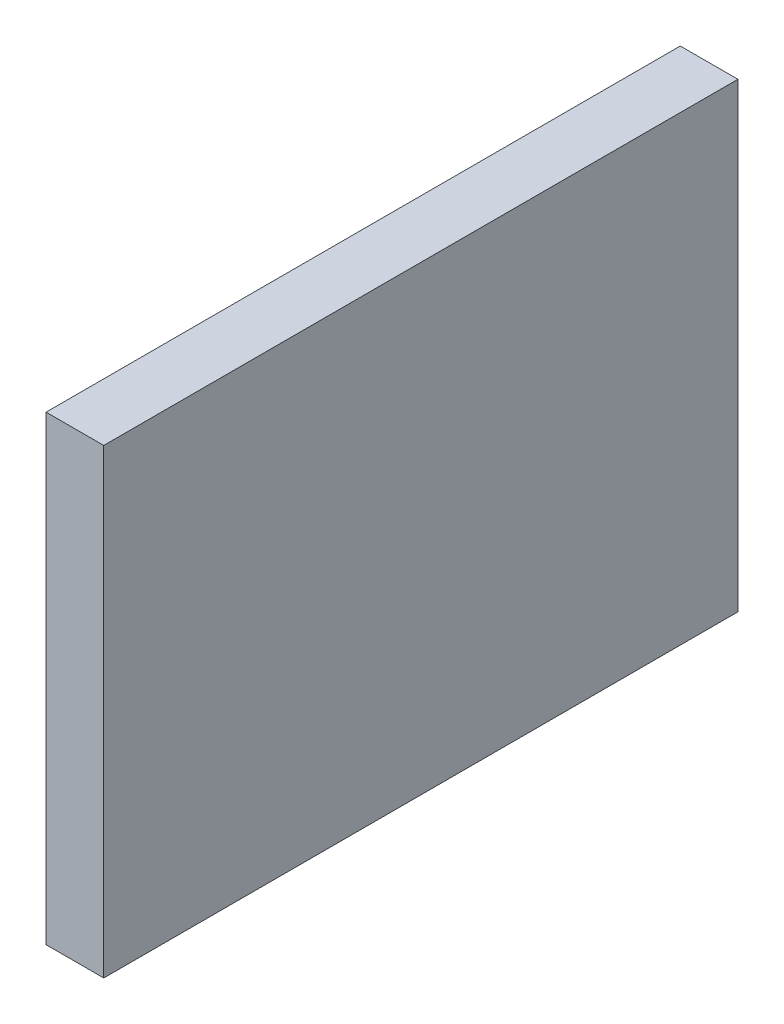
ISO-10303-21;
HEADER;
FILE_DESCRIPTION(('STEP AP214'),'2;1');
FILE_NAME('part.step','',(''),(''),'','','');
FILE_SCHEMA(('AUTOMOTIVE_DESIGN { 1 0 10303 214 1 1 1 1 }'));
ENDSEC;
DATA;
#1=APPLICATION_CONTEXT('core data for automotive mechanical design processes');
#2=APPLICATION_PROTOCOL_DEFINITION('international standard','automotive_design',2000,#1);
#3=PRODUCT_CONTEXT('',#1,'mechanical');
#4=PRODUCT('Part','Part','',(#3));
#5=PRODUCT_RELATED_PRODUCT_CATEGORY('part','',(#4));
#6=PRODUCT_DEFINITION_FORMATION('','',#4);
#7=PRODUCT_DEFINITION_CONTEXT('part definition',#1,'design');
#8=PRODUCT_DEFINITION('design','',#6,#7);
#9=PRODUCT_DEFINITION_SHAPE('','',#8);
#10=(LENGTH_UNIT() NAMED_UNIT(*) SI_UNIT(.MILLI.,.METRE.));
#11=(NAMED_UNIT(*) PLANE_ANGLE_UNIT() SI_UNIT($,.RADIAN.));
#12=(NAMED_UNIT(*) SI_UNIT($,.STERADIAN.) SOLID_ANGLE_UNIT());
#13=UNCERTAINTY_MEASURE_WITH_UNIT(LENGTH_MEASURE(1.E-05),#10,'distance_accuracy_value','');
#14=(GEOMETRIC_REPRESENTATION_CONTEXT(3) GLOBAL_UNCERTAINTY_ASSIGNED_CONTEXT((#13)) GLOBAL_UNIT_ASSIGNED_CONTEXT((#10,
#11,#12)) REPRESENTATION_CONTEXT('',''));
#15=CARTESIAN_POINT('',(0.,0.,0.));
#16=DIRECTION('',(0.,0.,1.));
#17=DIRECTION('',(1.,0.,0.));
#18=AXIS2_PLACEMENT_3D('',#15,#16,#17);
#19=CARTESIAN_POINT('',(919.39999,763.525305147521,484.181346806782));
#20=DIRECTION('',(1.,0.,0.));
#21=DIRECTION('',(0.,0.,-1.));
#22=AXIS2_PLACEMENT_3D('',#19,#20,#21);
#23=PLANE('',#22);
#24=DIRECTION('',(0.,-1.,0.));
#25=VECTOR('',#24,1.);
#26=CARTESIAN_POINT('',(919.39999,763.525305147521,279.399999999999));
#27=LINE('',#26,#25);
#28=CARTESIAN_POINT('',(919.39999,763.525305147521,279.399999999999));
#29=VERTEX_POINT('',#28);
#30=CARTESIAN_POINT('',(919.39999,560.325305147521,279.399999999999));
#31=VERTEX_POINT('',#30);
#32=EDGE_CURVE('E11',#29,#31,#27,.T.);
#33=ORIENTED_EDGE('',*,*,#32,.F.);
#34=DIRECTION('',(0.,0.,-1.));
#35=VECTOR('',#34,1.);
#36=CARTESIAN_POINT('',(919.39999,763.525305147521,484.181346806782));
#37=LINE('',#36,#35);
#38=CARTESIAN_POINT('',(919.39999,763.525305147521,0.));
#39=VERTEX_POINT('',#38);
#40=EDGE_CURVE('E90',#29,#39,#37,.T.);
#41=ORIENTED_EDGE('',*,*,#40,.T.);
#42=DIRECTION('',(0.,-1.,0.));
#43=VECTOR('',#42,1.);
#44=CARTESIAN_POINT('',(919.39999,763.525305147521,0.));
#45=LINE('',#44,#43);
#46=CARTESIAN_POINT('',(919.39999,560.325305147521,0.));
#47=VERTEX_POINT('',#46);
#48=EDGE_CURVE('E81',#39,#47,#45,.T.);
#49=ORIENTED_EDGE('',*,*,#48,.T.);
#50=DIRECTION('',(0.,0.,-1.));
#51=VECTOR('',#50,1.);
#52=CARTESIAN_POINT('',(919.39999,560.325305147521,484.181346806782));
#53=LINE('',#52,#51);
#54=EDGE_CURVE('E74',#31,#47,#53,.T.);
#55=ORIENTED_EDGE('',*,*,#54,.F.);
#56=EDGE_LOOP('',(#33,#41,#49,#55));
#57=FACE_BOUND('',#56,.T.);
#58=ADVANCED_FACE('F32',(#57),#23,.F.);
#59=CARTESIAN_POINT('',(919.39999,560.325305147521,484.181346806782));
#60=DIRECTION('',(0.,1.,0.));
#61=DIRECTION('',(0.,0.,1.));
#62=AXIS2_PLACEMENT_3D('',#59,#60,#61);
#63=PLANE('',#62);
#64=DIRECTION('',(1.,0.,0.));
#65=VECTOR('',#64,1.);
#66=CARTESIAN_POINT('',(919.39999,560.325305147521,279.399999999999));
#67=LINE('',#66,#65);
#68=CARTESIAN_POINT('',(944.79999,560.325305147521,279.399999999999));
#69=VERTEX_POINT('',#68);
#70=EDGE_CURVE('E36',#31,#69,#67,.T.);
#71=ORIENTED_EDGE('',*,*,#70,.F.);
#72=ORIENTED_EDGE('',*,*,#54,.T.);
#73=DIRECTION('',(1.,0.,0.));
#74=VECTOR('',#73,1.);
#75=CARTESIAN_POINT('',(919.39999,560.325305147521,0.));
#76=LINE('',#75,#74);
#77=CARTESIAN_POINT('',(944.79999,560.325305147521,0.));
#78=VERTEX_POINT('',#77);
#79=EDGE_CURVE('E77',#47,#78,#76,.T.);
#80=ORIENTED_EDGE('',*,*,#79,.T.);
#81=DIRECTION('',(0.,0.,-1.));
#82=VECTOR('',#81,1.);
#83=CARTESIAN_POINT('',(944.79999,560.325305147521,484.181346806782));
#84=LINE('',#83,#82);
#85=EDGE_CURVE('E69',#69,#78,#84,.T.);
#86=ORIENTED_EDGE('',*,*,#85,.F.);
#87=EDGE_LOOP('',(#71,#72,#80,#86));
#88=FACE_BOUND('',#87,.T.);
#89=ADVANCED_FACE('F76',(#88),#63,.F.);
#90=CARTESIAN_POINT('',(944.79999,763.525305147521,484.181346806782));
#91=DIRECTION('',(-1.,0.,0.));
#92=DIRECTION('',(0.,0.,1.));
#93=AXIS2_PLACEMENT_3D('',#90,#91,#92);
#94=PLANE('',#93);
#95=DIRECTION('',(0.,1.,0.));
#96=VECTOR('',#95,1.);
#97=CARTESIAN_POINT('',(944.79999,763.525305147521,279.399999999999));
#98=LINE('',#97,#96);
#99=CARTESIAN_POINT('',(944.79999,763.525305147521,279.399999999999));
#100=VERTEX_POINT('',#99);
#101=EDGE_CURVE('E95',#69,#100,#98,.T.);
#102=ORIENTED_EDGE('',*,*,#101,.F.);
#103=ORIENTED_EDGE('',*,*,#85,.T.);
#104=DIRECTION('',(0.,1.,0.));
#105=VECTOR('',#104,1.);
#106=CARTESIAN_POINT('',(944.79999,763.525305147521,0.));
#107=LINE('',#106,#105);
#108=CARTESIAN_POINT('',(944.79999,763.525305147521,0.));
#109=VERTEX_POINT('',#108);
#110=EDGE_CURVE('E87',#78,#109,#107,.T.);
#111=ORIENTED_EDGE('',*,*,#110,.T.);
#112=DIRECTION('',(0.,0.,-1.));
#113=VECTOR('',#112,1.);
#114=CARTESIAN_POINT('',(944.79999,763.525305147521,484.181346806782));
#115=LINE('',#114,#113);
#116=EDGE_CURVE('E98',#100,#109,#115,.T.);
#117=ORIENTED_EDGE('',*,*,#116,.F.);
#118=EDGE_LOOP('',(#102,#103,#111,#117));
#119=FACE_BOUND('',#118,.T.);
#120=ADVANCED_FACE('F105',(#119),#94,.F.);
#121=CARTESIAN_POINT('',(919.39999,763.525305147521,484.181346806782));
#122=DIRECTION('',(0.,-1.,0.));
#123=DIRECTION('',(0.,0.,-1.));
#124=AXIS2_PLACEMENT_3D('',#121,#122,#123);
#125=PLANE('',#124);
#126=DIRECTION('',(-1.,0.,0.));
#127=VECTOR('',#126,1.);
#128=CARTESIAN_POINT('',(919.39999,763.525305147521,279.399999999999));
#129=LINE('',#128,#127);
#130=EDGE_CURVE('E42',#100,#29,#129,.T.);
#131=ORIENTED_EDGE('',*,*,#130,.F.);
#132=ORIENTED_EDGE('',*,*,#116,.T.);
#133=DIRECTION('',(-1.,0.,0.));
#134=VECTOR('',#133,1.);
#135=CARTESIAN_POINT('',(919.39999,763.525305147521,0.));
#136=LINE('',#135,#134);
#137=EDGE_CURVE('E99',#109,#39,#136,.T.);
#138=ORIENTED_EDGE('',*,*,#137,.T.);
#139=ORIENTED_EDGE('',*,*,#40,.F.);
#140=EDGE_LOOP('',(#131,#132,#138,#139));
#141=FACE_BOUND('',#140,.T.);
#142=ADVANCED_FACE('F106',(#141),#125,.F.);
#143=CARTESIAN_POINT('',(0.,0.,0.));
#144=DIRECTION('',(0.,0.,1.));
#145=DIRECTION('',(1.,0.,0.));
#146=AXIS2_PLACEMENT_3D('',#143,#144,#145);
#147=PLANE('',#146);
#148=ORIENTED_EDGE('',*,*,#48,.F.);
#149=ORIENTED_EDGE('',*,*,#137,.F.);
#150=ORIENTED_EDGE('',*,*,#110,.F.);
#151=ORIENTED_EDGE('',*,*,#79,.F.);
#152=EDGE_LOOP('',(#148,#149,#150,#151));
#153=FACE_BOUND('',#152,.T.);
#154=ADVANCED_FACE('F85',(#153),#147,.F.);
#155=CARTESIAN_POINT('',(919.39999,1143.,279.399999999999));
#156=DIRECTION('',(0.,0.,1.));
#157=DIRECTION('',(1.,0.,0.));
#158=AXIS2_PLACEMENT_3D('',#155,#156,#157);
#159=PLANE('',#158);
#160=ORIENTED_EDGE('',*,*,#70,.T.);
#161=ORIENTED_EDGE('',*,*,#101,.T.);
#162=ORIENTED_EDGE('',*,*,#130,.T.);
#163=ORIENTED_EDGE('',*,*,#32,.T.);
#164=EDGE_LOOP('',(#160,#161,#162,#163));
#165=FACE_BOUND('',#164,.T.);
#166=ADVANCED_FACE('F34',(#165),#159,.T.);
#167=CLOSED_SHELL('',(#58,#89,#120,#142,#154,#166));
#168=MANIFOLD_SOLID_BREP('B2',#167);
#169=ADVANCED_BREP_SHAPE_REPRESENTATION('',(#18,#168),#14);
#170=SHAPE_DEFINITION_REPRESENTATION(#9,#169);
ENDSEC;
END-ISO-10303-21;
